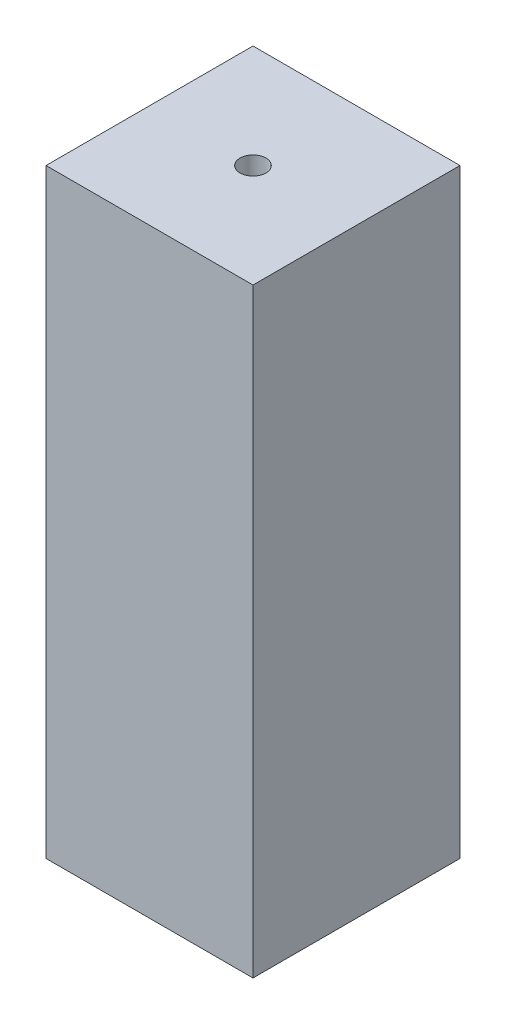
ISO-10303-21;
HEADER;
FILE_DESCRIPTION(('STEP AP214'),'2;1');
FILE_NAME('part.step','',(''),(''),'','','');
FILE_SCHEMA(('AUTOMOTIVE_DESIGN { 1 0 10303 214 1 1 1 1 }'));
ENDSEC;
DATA;
#1=APPLICATION_CONTEXT('core data for automotive mechanical design processes');
#2=APPLICATION_PROTOCOL_DEFINITION('international standard','automotive_design',2000,#1);
#3=PRODUCT_CONTEXT('',#1,'mechanical');
#4=PRODUCT('Part','Part','',(#3));
#5=PRODUCT_RELATED_PRODUCT_CATEGORY('part','',(#4));
#6=PRODUCT_DEFINITION_FORMATION('','',#4);
#7=PRODUCT_DEFINITION_CONTEXT('part definition',#1,'design');
#8=PRODUCT_DEFINITION('design','',#6,#7);
#9=PRODUCT_DEFINITION_SHAPE('','',#8);
#10=(LENGTH_UNIT() NAMED_UNIT(*) SI_UNIT(.MILLI.,.METRE.));
#11=(NAMED_UNIT(*) PLANE_ANGLE_UNIT() SI_UNIT($,.RADIAN.));
#12=(NAMED_UNIT(*) SI_UNIT($,.STERADIAN.) SOLID_ANGLE_UNIT());
#13=UNCERTAINTY_MEASURE_WITH_UNIT(LENGTH_MEASURE(1.E-05),#10,'distance_accuracy_value','');
#14=(GEOMETRIC_REPRESENTATION_CONTEXT(3) GLOBAL_UNCERTAINTY_ASSIGNED_CONTEXT((#13)) GLOBAL_UNIT_ASSIGNED_CONTEXT((#10,
#11,#12)) REPRESENTATION_CONTEXT('',''));
#15=CARTESIAN_POINT('',(0.,0.,0.));
#16=DIRECTION('',(0.,0.,1.));
#17=DIRECTION('',(1.,0.,0.));
#18=AXIS2_PLACEMENT_3D('',#15,#16,#17);
#19=CARTESIAN_POINT('',(12.7,73.65,12.7));
#20=DIRECTION('',(-1.,0.,0.));
#21=DIRECTION('',(0.,0.,1.));
#22=AXIS2_PLACEMENT_3D('',#19,#20,#21);
#23=PLANE('',#22);
#24=DIRECTION('',(0.,0.,-1.));
#25=VECTOR('',#24,1.);
#26=CARTESIAN_POINT('',(12.7,0.,12.7));
#27=LINE('',#26,#25);
#28=CARTESIAN_POINT('',(12.7,0.,12.7));
#29=VERTEX_POINT('',#28);
#30=CARTESIAN_POINT('',(12.7,0.,-12.7));
#31=VERTEX_POINT('',#30);
#32=EDGE_CURVE('E95',#29,#31,#27,.T.);
#33=ORIENTED_EDGE('',*,*,#32,.T.);
#34=DIRECTION('',(0.,-1.,0.));
#35=VECTOR('',#34,1.);
#36=CARTESIAN_POINT('',(12.7,73.65,-12.7));
#37=LINE('',#36,#35);
#38=CARTESIAN_POINT('',(12.7,73.65,-12.7));
#39=VERTEX_POINT('',#38);
#40=EDGE_CURVE('E11',#39,#31,#37,.T.);
#41=ORIENTED_EDGE('',*,*,#40,.F.);
#42=DIRECTION('',(0.,0.,-1.));
#43=VECTOR('',#42,1.);
#44=CARTESIAN_POINT('',(12.7,73.65,12.7));
#45=LINE('',#44,#43);
#46=CARTESIAN_POINT('',(12.7,73.65,12.7));
#47=VERTEX_POINT('',#46);
#48=EDGE_CURVE('E83',#47,#39,#45,.T.);
#49=ORIENTED_EDGE('',*,*,#48,.F.);
#50=DIRECTION('',(0.,-1.,0.));
#51=VECTOR('',#50,1.);
#52=CARTESIAN_POINT('',(12.7,73.65,12.7));
#53=LINE('',#52,#51);
#54=EDGE_CURVE('E91',#47,#29,#53,.T.);
#55=ORIENTED_EDGE('',*,*,#54,.T.);
#56=EDGE_LOOP('',(#33,#41,#49,#55));
#57=FACE_BOUND('',#56,.T.);
#58=ADVANCED_FACE('F32',(#57),#23,.F.);
#59=CARTESIAN_POINT('',(-12.7,73.65,-12.7));
#60=DIRECTION('',(0.,0.,1.));
#61=DIRECTION('',(1.,0.,0.));
#62=AXIS2_PLACEMENT_3D('',#59,#60,#61);
#63=PLANE('',#62);
#64=DIRECTION('',(-1.,0.,0.));
#65=VECTOR('',#64,1.);
#66=CARTESIAN_POINT('',(-12.7,0.,-12.7));
#67=LINE('',#66,#65);
#68=CARTESIAN_POINT('',(-12.7,0.,-12.7));
#69=VERTEX_POINT('',#68);
#70=EDGE_CURVE('E87',#31,#69,#67,.T.);
#71=ORIENTED_EDGE('',*,*,#70,.T.);
#72=DIRECTION('',(0.,-1.,0.));
#73=VECTOR('',#72,1.);
#74=CARTESIAN_POINT('',(-12.7,73.65,-12.7));
#75=LINE('',#74,#73);
#76=CARTESIAN_POINT('',(-12.7,73.65,-12.7));
#77=VERTEX_POINT('',#76);
#78=EDGE_CURVE('E40',#77,#69,#75,.T.);
#79=ORIENTED_EDGE('',*,*,#78,.F.);
#80=DIRECTION('',(-1.,0.,0.));
#81=VECTOR('',#80,1.);
#82=CARTESIAN_POINT('',(-12.7,73.65,-12.7));
#83=LINE('',#82,#81);
#84=EDGE_CURVE('E78',#39,#77,#83,.T.);
#85=ORIENTED_EDGE('',*,*,#84,.F.);
#86=ORIENTED_EDGE('',*,*,#40,.T.);
#87=EDGE_LOOP('',(#71,#79,#85,#86));
#88=FACE_BOUND('',#87,.T.);
#89=ADVANCED_FACE('F86',(#88),#63,.F.);
#90=CARTESIAN_POINT('',(-12.7,73.65,12.7));
#91=DIRECTION('',(1.,0.,0.));
#92=DIRECTION('',(0.,0.,-1.));
#93=AXIS2_PLACEMENT_3D('',#90,#91,#92);
#94=PLANE('',#93);
#95=DIRECTION('',(0.,0.,1.));
#96=VECTOR('',#95,1.);
#97=CARTESIAN_POINT('',(-12.7,0.,12.7));
#98=LINE('',#97,#96);
#99=CARTESIAN_POINT('',(-12.7,0.,12.7));
#100=VERTEX_POINT('',#99);
#101=EDGE_CURVE('E65',#69,#100,#98,.T.);
#102=ORIENTED_EDGE('',*,*,#101,.T.);
#103=DIRECTION('',(0.,-1.,0.));
#104=VECTOR('',#103,1.);
#105=CARTESIAN_POINT('',(-12.7,73.65,12.7));
#106=LINE('',#105,#104);
#107=CARTESIAN_POINT('',(-12.7,73.65,12.7));
#108=VERTEX_POINT('',#107);
#109=EDGE_CURVE('E88',#108,#100,#106,.T.);
#110=ORIENTED_EDGE('',*,*,#109,.F.);
#111=DIRECTION('',(0.,0.,1.));
#112=VECTOR('',#111,1.);
#113=CARTESIAN_POINT('',(-12.7,73.65,12.7));
#114=LINE('',#113,#112);
#115=EDGE_CURVE('E81',#77,#108,#114,.T.);
#116=ORIENTED_EDGE('',*,*,#115,.F.);
#117=ORIENTED_EDGE('',*,*,#78,.T.);
#118=EDGE_LOOP('',(#102,#110,#116,#117));
#119=FACE_BOUND('',#118,.T.);
#120=ADVANCED_FACE('F89',(#119),#94,.F.);
#121=CARTESIAN_POINT('',(-12.7,73.65,12.7));
#122=DIRECTION('',(0.,0.,-1.));
#123=DIRECTION('',(-1.,0.,0.));
#124=AXIS2_PLACEMENT_3D('',#121,#122,#123);
#125=PLANE('',#124);
#126=DIRECTION('',(1.,0.,0.));
#127=VECTOR('',#126,1.);
#128=CARTESIAN_POINT('',(-12.7,0.,12.7));
#129=LINE('',#128,#127);
#130=EDGE_CURVE('E71',#100,#29,#129,.T.);
#131=ORIENTED_EDGE('',*,*,#130,.T.);
#132=ORIENTED_EDGE('',*,*,#54,.F.);
#133=DIRECTION('',(1.,0.,0.));
#134=VECTOR('',#133,1.);
#135=CARTESIAN_POINT('',(-12.7,73.65,12.7));
#136=LINE('',#135,#134);
#137=EDGE_CURVE('E48',#108,#47,#136,.T.);
#138=ORIENTED_EDGE('',*,*,#137,.F.);
#139=ORIENTED_EDGE('',*,*,#109,.T.);
#140=EDGE_LOOP('',(#131,#132,#138,#139));
#141=FACE_BOUND('',#140,.T.);
#142=ADVANCED_FACE('F103',(#141),#125,.F.);
#143=CARTESIAN_POINT('',(0.,73.65,0.));
#144=DIRECTION('',(0.,-1.,0.));
#145=DIRECTION('',(0.,0.,-1.));
#146=AXIS2_PLACEMENT_3D('',#143,#144,#145);
#147=PLANE('',#146);
#148=CARTESIAN_POINT('',(0.,73.65,0.));
#149=DIRECTION('',(0.,1.,0.));
#150=DIRECTION('',(0.,0.,1.));
#151=AXIS2_PLACEMENT_3D('',#148,#149,#150);
#152=CIRCLE('',#151,1.59);
#153=CARTESIAN_POINT('',(0.,73.65,1.59));
#154=VERTEX_POINT('',#153);
#155=EDGE_CURVE('E109',#154,#154,#152,.T.);
#156=ORIENTED_EDGE('',*,*,#155,.F.);
#157=EDGE_LOOP('',(#156));
#158=FACE_BOUND('',#157,.T.);
#159=ORIENTED_EDGE('',*,*,#48,.T.);
#160=ORIENTED_EDGE('',*,*,#84,.T.);
#161=ORIENTED_EDGE('',*,*,#115,.T.);
#162=ORIENTED_EDGE('',*,*,#137,.T.);
#163=EDGE_LOOP('',(#159,#160,#161,#162));
#164=FACE_BOUND('',#163,.T.);
#165=ADVANCED_FACE('F79',(#158,#164),#147,.F.);
#166=CARTESIAN_POINT('',(0.,0.,0.));
#167=DIRECTION('',(0.,-1.,0.));
#168=DIRECTION('',(0.,0.,-1.));
#169=AXIS2_PLACEMENT_3D('',#166,#167,#168);
#170=PLANE('',#169);
#171=ORIENTED_EDGE('',*,*,#32,.F.);
#172=ORIENTED_EDGE('',*,*,#130,.F.);
#173=ORIENTED_EDGE('',*,*,#101,.F.);
#174=ORIENTED_EDGE('',*,*,#70,.F.);
#175=EDGE_LOOP('',(#171,#172,#173,#174));
#176=FACE_BOUND('',#175,.T.);
#177=ADVANCED_FACE('F106',(#176),#170,.T.);
#178=CARTESIAN_POINT('',(0.,48.25,0.));
#179=DIRECTION('',(0.,1.,0.));
#180=DIRECTION('',(0.,0.,1.));
#181=AXIS2_PLACEMENT_3D('',#178,#179,#180);
#182=CYLINDRICAL_SURFACE('',#181,1.59);
#183=CARTESIAN_POINT('',(0.,48.25,0.));
#184=DIRECTION('',(0.,1.,0.));
#185=DIRECTION('',(0.,0.,1.));
#186=AXIS2_PLACEMENT_3D('',#183,#184,#185);
#187=CIRCLE('',#186,1.59);
#188=CARTESIAN_POINT('',(0.,48.25,1.59));
#189=VERTEX_POINT('',#188);
#190=EDGE_CURVE('E98',#189,#189,#187,.T.);
#191=ORIENTED_EDGE('',*,*,#190,.F.);
#192=EDGE_LOOP('',(#191));
#193=FACE_BOUND('',#192,.T.);
#194=ORIENTED_EDGE('',*,*,#155,.T.);
#195=EDGE_LOOP('',(#194));
#196=FACE_BOUND('',#195,.T.);
#197=ADVANCED_FACE('F117',(#193,#196),#182,.F.);
#198=CARTESIAN_POINT('',(0.,48.25,0.));
#199=DIRECTION('',(0.,1.,0.));
#200=DIRECTION('',(0.,0.,1.));
#201=AXIS2_PLACEMENT_3D('',#198,#199,#200);
#202=PLANE('',#201);
#203=ORIENTED_EDGE('',*,*,#190,.T.);
#204=EDGE_LOOP('',(#203));
#205=FACE_BOUND('',#204,.T.);
#206=ADVANCED_FACE('F115',(#205),#202,.T.);
#207=CLOSED_SHELL('',(#58,#89,#120,#142,#165,#177,#197,#206));
#208=MANIFOLD_SOLID_BREP('B2',#207);
#209=ADVANCED_BREP_SHAPE_REPRESENTATION('',(#18,#208),#14);
#210=SHAPE_DEFINITION_REPRESENTATION(#9,#209);
ENDSEC;
END-ISO-10303-21;
